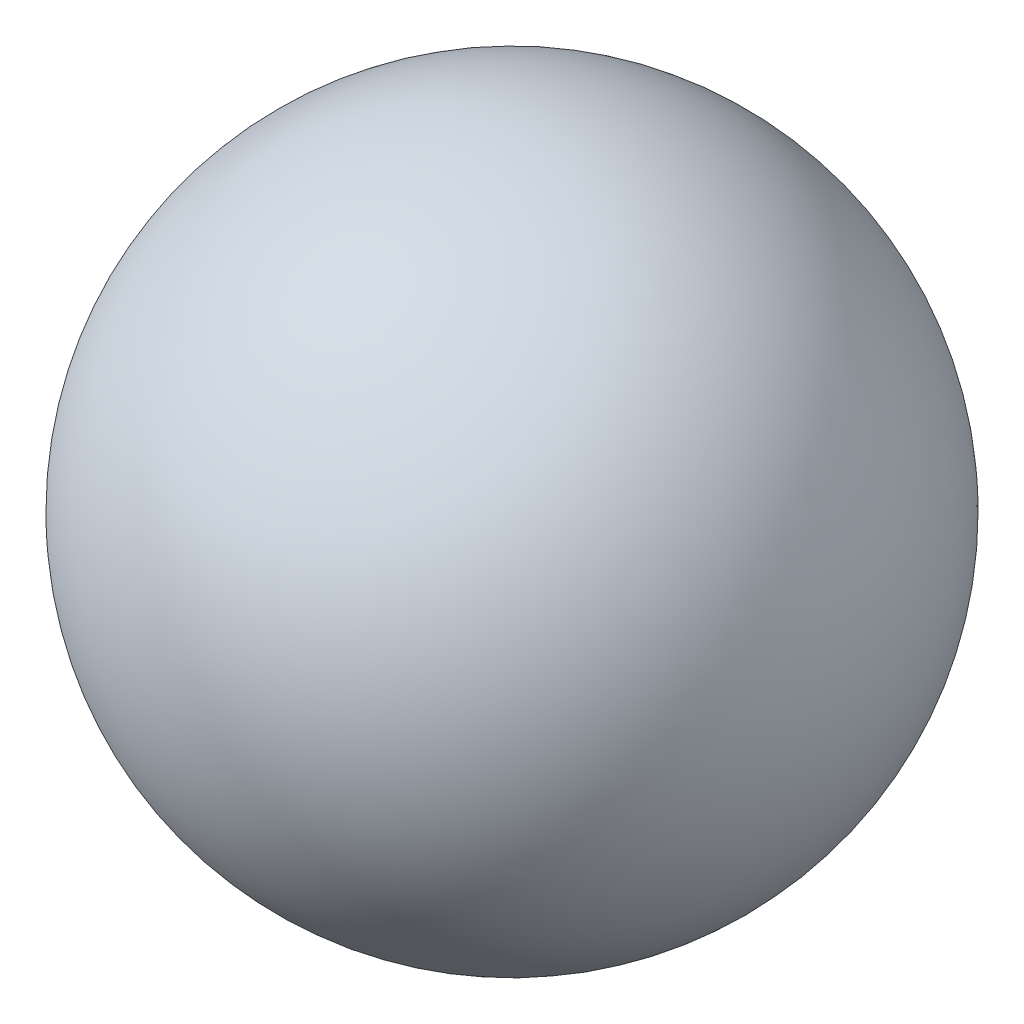
ISO-10303-21;
HEADER;
FILE_DESCRIPTION(('STEP AP214'),'2;1');
FILE_NAME('part.step','',(''),(''),'','','');
FILE_SCHEMA(('AUTOMOTIVE_DESIGN { 1 0 10303 214 1 1 1 1 }'));
ENDSEC;
DATA;
#1=APPLICATION_CONTEXT('core data for automotive mechanical design processes');
#2=APPLICATION_PROTOCOL_DEFINITION('international standard','automotive_design',2000,#1);
#3=PRODUCT_CONTEXT('',#1,'mechanical');
#4=PRODUCT('Part','Part','',(#3));
#5=PRODUCT_RELATED_PRODUCT_CATEGORY('part','',(#4));
#6=PRODUCT_DEFINITION_FORMATION('','',#4);
#7=PRODUCT_DEFINITION_CONTEXT('part definition',#1,'design');
#8=PRODUCT_DEFINITION('design','',#6,#7);
#9=PRODUCT_DEFINITION_SHAPE('','',#8);
#10=(LENGTH_UNIT() NAMED_UNIT(*) SI_UNIT(.MILLI.,.METRE.));
#11=(NAMED_UNIT(*) PLANE_ANGLE_UNIT() SI_UNIT($,.RADIAN.));
#12=(NAMED_UNIT(*) SI_UNIT($,.STERADIAN.) SOLID_ANGLE_UNIT());
#13=UNCERTAINTY_MEASURE_WITH_UNIT(LENGTH_MEASURE(1.E-05),#10,'distance_accuracy_value','');
#14=(GEOMETRIC_REPRESENTATION_CONTEXT(3) GLOBAL_UNCERTAINTY_ASSIGNED_CONTEXT((#13)) GLOBAL_UNIT_ASSIGNED_CONTEXT((#10,
#11,#12)) REPRESENTATION_CONTEXT('',''));
#15=CARTESIAN_POINT('',(0.,0.,0.));
#16=DIRECTION('',(0.,0.,1.));
#17=DIRECTION('',(1.,0.,0.));
#18=AXIS2_PLACEMENT_3D('',#15,#16,#17);
#19=CARTESIAN_POINT('',(5.15762239728178,0.,-6.11546655677695));
#20=DIRECTION('',(-0.644702799660222,0.,0.764433319597119));
#21=DIRECTION('',(-0.764433319597119,0.,-0.644702799660222));
#22=AXIS2_PLACEMENT_3D('',#19,#20,#21);
#23=SPHERICAL_SURFACE('',#22,8.);
#24=CARTESIAN_POINT('',(0.,0.,0.));
#25=VERTEX_POINT('',#24);
#26=VERTEX_LOOP('',#25);
#27=FACE_BOUND('',#26,.T.);
#28=ADVANCED_FACE('F33',(#27),#23,.T.);
#29=CLOSED_SHELL('',(#28));
#30=MANIFOLD_SOLID_BREP('B2',#29);
#31=ADVANCED_BREP_SHAPE_REPRESENTATION('',(#18,#30),#14);
#32=SHAPE_DEFINITION_REPRESENTATION(#9,#31);
ENDSEC;
END-ISO-10303-21;
